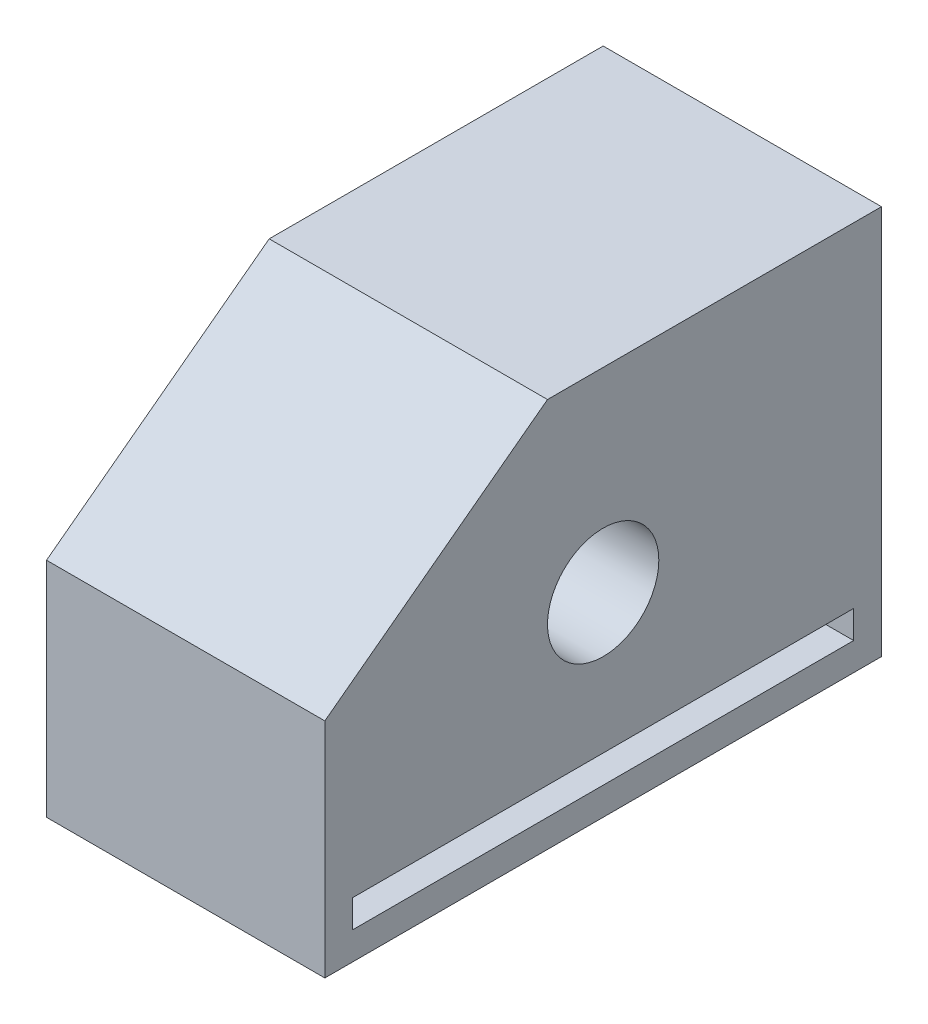
ISO-10303-21;
HEADER;
FILE_DESCRIPTION(('STEP AP214'),'2;1');
FILE_NAME('part.step','',(''),(''),'','','');
FILE_SCHEMA(('AUTOMOTIVE_DESIGN { 1 0 10303 214 1 1 1 1 }'));
ENDSEC;
DATA;
#1=APPLICATION_CONTEXT('core data for automotive mechanical design processes');
#2=APPLICATION_PROTOCOL_DEFINITION('international standard','automotive_design',2000,#1);
#3=PRODUCT_CONTEXT('',#1,'mechanical');
#4=PRODUCT('Part','Part','',(#3));
#5=PRODUCT_RELATED_PRODUCT_CATEGORY('part','',(#4));
#6=PRODUCT_DEFINITION_FORMATION('','',#4);
#7=PRODUCT_DEFINITION_CONTEXT('part definition',#1,'design');
#8=PRODUCT_DEFINITION('design','',#6,#7);
#9=PRODUCT_DEFINITION_SHAPE('','',#8);
#10=(LENGTH_UNIT() NAMED_UNIT(*) SI_UNIT(.MILLI.,.METRE.));
#11=(NAMED_UNIT(*) PLANE_ANGLE_UNIT() SI_UNIT($,.RADIAN.));
#12=(NAMED_UNIT(*) SI_UNIT($,.STERADIAN.) SOLID_ANGLE_UNIT());
#13=UNCERTAINTY_MEASURE_WITH_UNIT(LENGTH_MEASURE(1.E-05),#10,'distance_accuracy_value','');
#14=(GEOMETRIC_REPRESENTATION_CONTEXT(3) GLOBAL_UNCERTAINTY_ASSIGNED_CONTEXT((#13)) GLOBAL_UNIT_ASSIGNED_CONTEXT((#10,
#11,#12)) REPRESENTATION_CONTEXT('',''));
#15=CARTESIAN_POINT('',(0.,0.,0.));
#16=DIRECTION('',(0.,0.,1.));
#17=DIRECTION('',(1.,0.,0.));
#18=AXIS2_PLACEMENT_3D('',#15,#16,#17);
#19=CARTESIAN_POINT('',(50.,0.,0.));
#20=DIRECTION('',(0.,1.,0.));
#21=DIRECTION('',(0.,0.,1.));
#22=AXIS2_PLACEMENT_3D('',#19,#20,#21);
#23=PLANE('',#22);
#24=DIRECTION('',(0.,0.,-1.));
#25=VECTOR('',#24,1.);
#26=CARTESIAN_POINT('',(0.,0.,0.));
#27=LINE('',#26,#25);
#28=CARTESIAN_POINT('',(0.,0.,0.));
#29=VERTEX_POINT('',#28);
#30=CARTESIAN_POINT('',(0.,0.,-100.));
#31=VERTEX_POINT('',#30);
#32=EDGE_CURVE('E145',#29,#31,#27,.T.);
#33=ORIENTED_EDGE('',*,*,#32,.T.);
#34=DIRECTION('',(-1.,0.,0.));
#35=VECTOR('',#34,1.);
#36=CARTESIAN_POINT('',(50.,0.,-100.));
#37=LINE('',#36,#35);
#38=CARTESIAN_POINT('',(50.,0.,-100.));
#39=VERTEX_POINT('',#38);
#40=EDGE_CURVE('E11',#39,#31,#37,.T.);
#41=ORIENTED_EDGE('',*,*,#40,.F.);
#42=DIRECTION('',(0.,0.,-1.));
#43=VECTOR('',#42,1.);
#44=CARTESIAN_POINT('',(50.,0.,0.));
#45=LINE('',#44,#43);
#46=CARTESIAN_POINT('',(50.,0.,0.));
#47=VERTEX_POINT('',#46);
#48=EDGE_CURVE('E148',#47,#39,#45,.T.);
#49=ORIENTED_EDGE('',*,*,#48,.F.);
#50=DIRECTION('',(-1.,0.,0.));
#51=VECTOR('',#50,1.);
#52=CARTESIAN_POINT('',(50.,0.,0.));
#53=LINE('',#52,#51);
#54=EDGE_CURVE('E163',#47,#29,#53,.T.);
#55=ORIENTED_EDGE('',*,*,#54,.T.);
#56=EDGE_LOOP('',(#33,#41,#49,#55));
#57=FACE_BOUND('',#56,.T.);
#58=ADVANCED_FACE('F35',(#57),#23,.F.);
#59=CARTESIAN_POINT('',(50.,0.,-100.));
#60=DIRECTION('',(0.,0.,1.));
#61=DIRECTION('',(1.,0.,0.));
#62=AXIS2_PLACEMENT_3D('',#59,#60,#61);
#63=PLANE('',#62);
#64=DIRECTION('',(0.,1.,0.));
#65=VECTOR('',#64,1.);
#66=CARTESIAN_POINT('',(0.,0.,-100.));
#67=LINE('',#66,#65);
#68=CARTESIAN_POINT('',(0.,70.,-100.));
#69=VERTEX_POINT('',#68);
#70=EDGE_CURVE('E166',#31,#69,#67,.T.);
#71=ORIENTED_EDGE('',*,*,#70,.T.);
#72=DIRECTION('',(-1.,0.,0.));
#73=VECTOR('',#72,1.);
#74=CARTESIAN_POINT('',(50.,70.,-100.));
#75=LINE('',#74,#73);
#76=CARTESIAN_POINT('',(50.,70.,-100.));
#77=VERTEX_POINT('',#76);
#78=EDGE_CURVE('E42',#77,#69,#75,.T.);
#79=ORIENTED_EDGE('',*,*,#78,.F.);
#80=DIRECTION('',(0.,1.,0.));
#81=VECTOR('',#80,1.);
#82=CARTESIAN_POINT('',(50.,0.,-100.));
#83=LINE('',#82,#81);
#84=EDGE_CURVE('E151',#39,#77,#83,.T.);
#85=ORIENTED_EDGE('',*,*,#84,.F.);
#86=ORIENTED_EDGE('',*,*,#40,.T.);
#87=EDGE_LOOP('',(#71,#79,#85,#86));
#88=FACE_BOUND('',#87,.T.);
#89=ADVANCED_FACE('F187',(#88),#63,.F.);
#90=CARTESIAN_POINT('',(50.,70.,0.));
#91=DIRECTION('',(0.,1.,0.));
#92=DIRECTION('',(0.,0.,1.));
#93=AXIS2_PLACEMENT_3D('',#90,#91,#92);
#94=PLANE('',#93);
#95=DIRECTION('',(0.,0.,-1.));
#96=VECTOR('',#95,1.);
#97=CARTESIAN_POINT('',(0.,70.,0.));
#98=LINE('',#97,#96);
#99=CARTESIAN_POINT('',(0.,70.,-40.));
#100=VERTEX_POINT('',#99);
#101=EDGE_CURVE('E169',#100,#69,#98,.T.);
#102=ORIENTED_EDGE('',*,*,#101,.F.);
#103=DIRECTION('',(-1.,0.,0.));
#104=VECTOR('',#103,1.);
#105=CARTESIAN_POINT('',(50.,70.,-40.));
#106=LINE('',#105,#104);
#107=CARTESIAN_POINT('',(50.,70.,-40.));
#108=VERTEX_POINT('',#107);
#109=EDGE_CURVE('E180',#108,#100,#106,.T.);
#110=ORIENTED_EDGE('',*,*,#109,.F.);
#111=DIRECTION('',(0.,0.,-1.));
#112=VECTOR('',#111,1.);
#113=CARTESIAN_POINT('',(50.,70.,0.));
#114=LINE('',#113,#112);
#115=EDGE_CURVE('E154',#108,#77,#114,.T.);
#116=ORIENTED_EDGE('',*,*,#115,.T.);
#117=ORIENTED_EDGE('',*,*,#78,.T.);
#118=EDGE_LOOP('',(#102,#110,#116,#117));
#119=FACE_BOUND('',#118,.T.);
#120=ADVANCED_FACE('F184',(#119),#94,.T.);
#121=CARTESIAN_POINT('',(50.,25.6,19.2));
#122=DIRECTION('',(0.,0.8,0.6));
#123=DIRECTION('',(0.,-0.6,0.8));
#124=AXIS2_PLACEMENT_3D('',#121,#122,#123);
#125=PLANE('',#124);
#126=DIRECTION('',(0.,0.6,-0.8));
#127=VECTOR('',#126,1.);
#128=CARTESIAN_POINT('',(0.,25.6,19.2));
#129=LINE('',#128,#127);
#130=CARTESIAN_POINT('',(0.,40.,0.));
#131=VERTEX_POINT('',#130);
#132=EDGE_CURVE('E172',#131,#100,#129,.T.);
#133=ORIENTED_EDGE('',*,*,#132,.F.);
#134=DIRECTION('',(-1.,0.,0.));
#135=VECTOR('',#134,1.);
#136=CARTESIAN_POINT('',(50.,40.,0.));
#137=LINE('',#136,#135);
#138=CARTESIAN_POINT('',(50.,40.,0.));
#139=VERTEX_POINT('',#138);
#140=EDGE_CURVE('E178',#139,#131,#137,.T.);
#141=ORIENTED_EDGE('',*,*,#140,.F.);
#142=DIRECTION('',(0.,0.6,-0.8));
#143=VECTOR('',#142,1.);
#144=CARTESIAN_POINT('',(50.,25.6,19.2));
#145=LINE('',#144,#143);
#146=EDGE_CURVE('E157',#139,#108,#145,.T.);
#147=ORIENTED_EDGE('',*,*,#146,.T.);
#148=ORIENTED_EDGE('',*,*,#109,.T.);
#149=EDGE_LOOP('',(#133,#141,#147,#148));
#150=FACE_BOUND('',#149,.T.);
#151=ADVANCED_FACE('F194',(#150),#125,.T.);
#152=CARTESIAN_POINT('',(50.,0.,0.));
#153=DIRECTION('',(0.,0.,1.));
#154=DIRECTION('',(1.,0.,0.));
#155=AXIS2_PLACEMENT_3D('',#152,#153,#154);
#156=PLANE('',#155);
#157=DIRECTION('',(0.,1.,0.));
#158=VECTOR('',#157,1.);
#159=CARTESIAN_POINT('',(0.,0.,0.));
#160=LINE('',#159,#158);
#161=EDGE_CURVE('E152',#29,#131,#160,.T.);
#162=ORIENTED_EDGE('',*,*,#161,.F.);
#163=ORIENTED_EDGE('',*,*,#54,.F.);
#164=DIRECTION('',(0.,1.,0.));
#165=VECTOR('',#164,1.);
#166=CARTESIAN_POINT('',(50.,0.,0.));
#167=LINE('',#166,#165);
#168=EDGE_CURVE('E160',#47,#139,#167,.T.);
#169=ORIENTED_EDGE('',*,*,#168,.T.);
#170=ORIENTED_EDGE('',*,*,#140,.T.);
#171=EDGE_LOOP('',(#162,#163,#169,#170));
#172=FACE_BOUND('',#171,.T.);
#173=ADVANCED_FACE('F202',(#172),#156,.T.);
#174=CARTESIAN_POINT('',(50.,0.,0.));
#175=DIRECTION('',(1.,0.,0.));
#176=DIRECTION('',(0.,0.,-1.));
#177=AXIS2_PLACEMENT_3D('',#174,#175,#176);
#178=PLANE('',#177);
#179=DIRECTION('',(0.,-1.,0.));
#180=VECTOR('',#179,1.);
#181=CARTESIAN_POINT('',(50.,5.,-5.));
#182=LINE('',#181,#180);
#183=CARTESIAN_POINT('',(50.,10.,-5.));
#184=VERTEX_POINT('',#183);
#185=CARTESIAN_POINT('',(50.,5.,-5.));
#186=VERTEX_POINT('',#185);
#187=EDGE_CURVE('E49',#184,#186,#182,.T.);
#188=ORIENTED_EDGE('',*,*,#187,.F.);
#189=DIRECTION('',(0.,0.,1.));
#190=VECTOR('',#189,1.);
#191=CARTESIAN_POINT('',(50.,10.,-5.));
#192=LINE('',#191,#190);
#193=CARTESIAN_POINT('',(50.,10.,-95.));
#194=VERTEX_POINT('',#193);
#195=EDGE_CURVE('E123',#194,#184,#192,.T.);
#196=ORIENTED_EDGE('',*,*,#195,.F.);
#197=DIRECTION('',(0.,1.,0.));
#198=VECTOR('',#197,1.);
#199=CARTESIAN_POINT('',(50.,5.,-95.));
#200=LINE('',#199,#198);
#201=CARTESIAN_POINT('',(50.,5.,-95.));
#202=VERTEX_POINT('',#201);
#203=EDGE_CURVE('E126',#202,#194,#200,.T.);
#204=ORIENTED_EDGE('',*,*,#203,.F.);
#205=DIRECTION('',(0.,0.,-1.));
#206=VECTOR('',#205,1.);
#207=CARTESIAN_POINT('',(50.,5.,-5.));
#208=LINE('',#207,#206);
#209=EDGE_CURVE('E132',#186,#202,#208,.T.);
#210=ORIENTED_EDGE('',*,*,#209,.F.);
#211=EDGE_LOOP('',(#188,#196,#204,#210));
#212=FACE_BOUND('',#211,.T.);
#213=CARTESIAN_POINT('',(50.,35.,-50.));
#214=DIRECTION('',(1.,0.,0.));
#215=DIRECTION('',(0.,0.,-1.));
#216=AXIS2_PLACEMENT_3D('',#213,#214,#215);
#217=CIRCLE('',#216,10.);
#218=CARTESIAN_POINT('',(50.,35.,-60.));
#219=VERTEX_POINT('',#218);
#220=EDGE_CURVE('E138',#219,#219,#217,.T.);
#221=ORIENTED_EDGE('',*,*,#220,.F.);
#222=EDGE_LOOP('',(#221));
#223=FACE_BOUND('',#222,.T.);
#224=ORIENTED_EDGE('',*,*,#48,.T.);
#225=ORIENTED_EDGE('',*,*,#84,.T.);
#226=ORIENTED_EDGE('',*,*,#115,.F.);
#227=ORIENTED_EDGE('',*,*,#146,.F.);
#228=ORIENTED_EDGE('',*,*,#168,.F.);
#229=EDGE_LOOP('',(#224,#225,#226,#227,#228));
#230=FACE_BOUND('',#229,.T.);
#231=ADVANCED_FACE('F197',(#212,#223,#230),#178,.T.);
#232=CARTESIAN_POINT('',(0.,0.,0.));
#233=DIRECTION('',(1.,0.,0.));
#234=DIRECTION('',(0.,0.,-1.));
#235=AXIS2_PLACEMENT_3D('',#232,#233,#234);
#236=PLANE('',#235);
#237=DIRECTION('',(0.,0.,1.));
#238=VECTOR('',#237,1.);
#239=CARTESIAN_POINT('',(0.,10.,-5.));
#240=LINE('',#239,#238);
#241=CARTESIAN_POINT('',(0.,10.,-95.));
#242=VERTEX_POINT('',#241);
#243=CARTESIAN_POINT('',(0.,10.,-5.));
#244=VERTEX_POINT('',#243);
#245=EDGE_CURVE('E113',#242,#244,#240,.T.);
#246=ORIENTED_EDGE('',*,*,#245,.T.);
#247=DIRECTION('',(0.,-1.,0.));
#248=VECTOR('',#247,1.);
#249=CARTESIAN_POINT('',(0.,5.,-5.));
#250=LINE('',#249,#248);
#251=CARTESIAN_POINT('',(0.,5.,-5.));
#252=VERTEX_POINT('',#251);
#253=EDGE_CURVE('E107',#244,#252,#250,.T.);
#254=ORIENTED_EDGE('',*,*,#253,.T.);
#255=DIRECTION('',(0.,0.,-1.));
#256=VECTOR('',#255,1.);
#257=CARTESIAN_POINT('',(0.,5.,-5.));
#258=LINE('',#257,#256);
#259=CARTESIAN_POINT('',(0.,5.,-95.));
#260=VERTEX_POINT('',#259);
#261=EDGE_CURVE('E116',#252,#260,#258,.T.);
#262=ORIENTED_EDGE('',*,*,#261,.T.);
#263=DIRECTION('',(0.,1.,0.));
#264=VECTOR('',#263,1.);
#265=CARTESIAN_POINT('',(0.,5.,-95.));
#266=LINE('',#265,#264);
#267=EDGE_CURVE('E57',#260,#242,#266,.T.);
#268=ORIENTED_EDGE('',*,*,#267,.T.);
#269=EDGE_LOOP('',(#246,#254,#262,#268));
#270=FACE_BOUND('',#269,.T.);
#271=CARTESIAN_POINT('',(0.,35.,-50.));
#272=DIRECTION('',(1.,0.,0.));
#273=DIRECTION('',(0.,0.,-1.));
#274=AXIS2_PLACEMENT_3D('',#271,#272,#273);
#275=CIRCLE('',#274,10.);
#276=CARTESIAN_POINT('',(0.,35.,-60.));
#277=VERTEX_POINT('',#276);
#278=EDGE_CURVE('E142',#277,#277,#275,.T.);
#279=ORIENTED_EDGE('',*,*,#278,.T.);
#280=EDGE_LOOP('',(#279));
#281=FACE_BOUND('',#280,.T.);
#282=ORIENTED_EDGE('',*,*,#32,.F.);
#283=ORIENTED_EDGE('',*,*,#161,.T.);
#284=ORIENTED_EDGE('',*,*,#132,.T.);
#285=ORIENTED_EDGE('',*,*,#101,.T.);
#286=ORIENTED_EDGE('',*,*,#70,.F.);
#287=EDGE_LOOP('',(#282,#283,#284,#285,#286));
#288=FACE_BOUND('',#287,.T.);
#289=ADVANCED_FACE('F120',(#270,#281,#288),#236,.F.);
#290=CARTESIAN_POINT('',(0.,35.,-50.));
#291=DIRECTION('',(1.,0.,0.));
#292=DIRECTION('',(0.,0.,-1.));
#293=AXIS2_PLACEMENT_3D('',#290,#291,#292);
#294=CYLINDRICAL_SURFACE('',#293,10.);
#295=ORIENTED_EDGE('',*,*,#278,.F.);
#296=EDGE_LOOP('',(#295));
#297=FACE_BOUND('',#296,.T.);
#298=ORIENTED_EDGE('',*,*,#220,.T.);
#299=EDGE_LOOP('',(#298));
#300=FACE_BOUND('',#299,.T.);
#301=ADVANCED_FACE('F237',(#297,#300),#294,.F.);
#302=CARTESIAN_POINT('',(0.,5.,-5.));
#303=DIRECTION('',(0.,0.,1.));
#304=DIRECTION('',(1.,0.,0.));
#305=AXIS2_PLACEMENT_3D('',#302,#303,#304);
#306=PLANE('',#305);
#307=ORIENTED_EDGE('',*,*,#187,.T.);
#308=DIRECTION('',(1.,0.,0.));
#309=VECTOR('',#308,1.);
#310=CARTESIAN_POINT('',(0.,5.,-5.));
#311=LINE('',#310,#309);
#312=EDGE_CURVE('E103',#252,#186,#311,.T.);
#313=ORIENTED_EDGE('',*,*,#312,.F.);
#314=ORIENTED_EDGE('',*,*,#253,.F.);
#315=DIRECTION('',(1.,0.,0.));
#316=VECTOR('',#315,1.);
#317=CARTESIAN_POINT('',(0.,10.,-5.));
#318=LINE('',#317,#316);
#319=EDGE_CURVE('E136',#244,#184,#318,.T.);
#320=ORIENTED_EDGE('',*,*,#319,.T.);
#321=EDGE_LOOP('',(#307,#313,#314,#320));
#322=FACE_BOUND('',#321,.T.);
#323=ADVANCED_FACE('F105',(#322),#306,.F.);
#324=CARTESIAN_POINT('',(0.,10.,-5.));
#325=DIRECTION('',(0.,1.,0.));
#326=DIRECTION('',(0.,0.,1.));
#327=AXIS2_PLACEMENT_3D('',#324,#325,#326);
#328=PLANE('',#327);
#329=ORIENTED_EDGE('',*,*,#195,.T.);
#330=ORIENTED_EDGE('',*,*,#319,.F.);
#331=ORIENTED_EDGE('',*,*,#245,.F.);
#332=DIRECTION('',(1.,0.,0.));
#333=VECTOR('',#332,1.);
#334=CARTESIAN_POINT('',(0.,10.,-95.));
#335=LINE('',#334,#333);
#336=EDGE_CURVE('E139',#242,#194,#335,.T.);
#337=ORIENTED_EDGE('',*,*,#336,.T.);
#338=EDGE_LOOP('',(#329,#330,#331,#337));
#339=FACE_BOUND('',#338,.T.);
#340=ADVANCED_FACE('F263',(#339),#328,.F.);
#341=CARTESIAN_POINT('',(0.,5.,-95.));
#342=DIRECTION('',(0.,0.,-1.));
#343=DIRECTION('',(-1.,0.,0.));
#344=AXIS2_PLACEMENT_3D('',#341,#342,#343);
#345=PLANE('',#344);
#346=ORIENTED_EDGE('',*,*,#203,.T.);
#347=ORIENTED_EDGE('',*,*,#336,.F.);
#348=ORIENTED_EDGE('',*,*,#267,.F.);
#349=DIRECTION('',(1.,0.,0.));
#350=VECTOR('',#349,1.);
#351=CARTESIAN_POINT('',(0.,5.,-95.));
#352=LINE('',#351,#350);
#353=EDGE_CURVE('E112',#260,#202,#352,.T.);
#354=ORIENTED_EDGE('',*,*,#353,.T.);
#355=EDGE_LOOP('',(#346,#347,#348,#354));
#356=FACE_BOUND('',#355,.T.);
#357=ADVANCED_FACE('F272',(#356),#345,.F.);
#358=CARTESIAN_POINT('',(0.,5.,-5.));
#359=DIRECTION('',(0.,-1.,0.));
#360=DIRECTION('',(0.,0.,-1.));
#361=AXIS2_PLACEMENT_3D('',#358,#359,#360);
#362=PLANE('',#361);
#363=ORIENTED_EDGE('',*,*,#209,.T.);
#364=ORIENTED_EDGE('',*,*,#353,.F.);
#365=ORIENTED_EDGE('',*,*,#261,.F.);
#366=ORIENTED_EDGE('',*,*,#312,.T.);
#367=EDGE_LOOP('',(#363,#364,#365,#366));
#368=FACE_BOUND('',#367,.T.);
#369=ADVANCED_FACE('F117',(#368),#362,.F.);
#370=CLOSED_SHELL('',(#58,#89,#120,#151,#173,#231,#289,#301,#323,#340,#357,#369));
#371=MANIFOLD_SOLID_BREP('B2',#370);
#372=ADVANCED_BREP_SHAPE_REPRESENTATION('',(#18,#371),#14);
#373=SHAPE_DEFINITION_REPRESENTATION(#9,#372);
ENDSEC;
END-ISO-10303-21;
